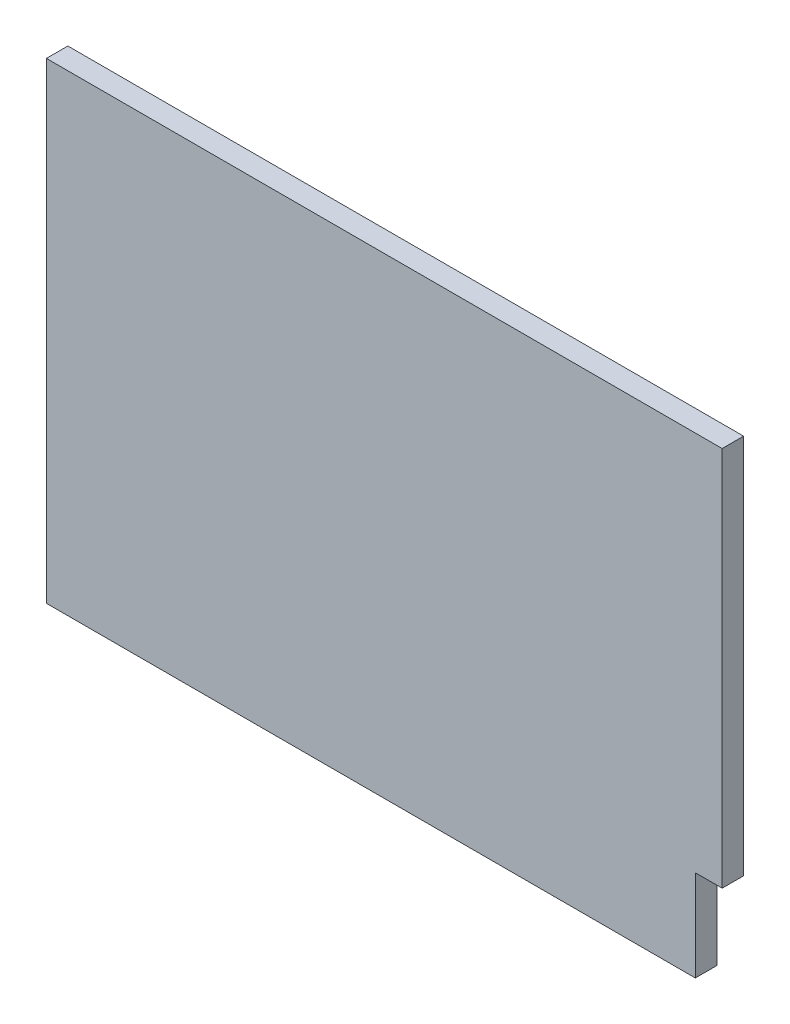
ISO-10303-21;
HEADER;
FILE_DESCRIPTION(('STEP AP214'),'2;1');
FILE_NAME('part.step','',(''),(''),'','','');
FILE_SCHEMA(('AUTOMOTIVE_DESIGN { 1 0 10303 214 1 1 1 1 }'));
ENDSEC;
DATA;
#1=APPLICATION_CONTEXT('core data for automotive mechanical design processes');
#2=APPLICATION_PROTOCOL_DEFINITION('international standard','automotive_design',2000,#1);
#3=PRODUCT_CONTEXT('',#1,'mechanical');
#4=PRODUCT('Part','Part','',(#3));
#5=PRODUCT_RELATED_PRODUCT_CATEGORY('part','',(#4));
#6=PRODUCT_DEFINITION_FORMATION('','',#4);
#7=PRODUCT_DEFINITION_CONTEXT('part definition',#1,'design');
#8=PRODUCT_DEFINITION('design','',#6,#7);
#9=PRODUCT_DEFINITION_SHAPE('','',#8);
#10=(LENGTH_UNIT() NAMED_UNIT(*) SI_UNIT(.MILLI.,.METRE.));
#11=(NAMED_UNIT(*) PLANE_ANGLE_UNIT() SI_UNIT($,.RADIAN.));
#12=(NAMED_UNIT(*) SI_UNIT($,.STERADIAN.) SOLID_ANGLE_UNIT());
#13=UNCERTAINTY_MEASURE_WITH_UNIT(LENGTH_MEASURE(1.E-05),#10,'distance_accuracy_value','');
#14=(GEOMETRIC_REPRESENTATION_CONTEXT(3) GLOBAL_UNCERTAINTY_ASSIGNED_CONTEXT((#13)) GLOBAL_UNIT_ASSIGNED_CONTEXT((#10,
#11,#12)) REPRESENTATION_CONTEXT('',''));
#15=CARTESIAN_POINT('',(0.,0.,0.));
#16=DIRECTION('',(0.,0.,1.));
#17=DIRECTION('',(1.,0.,0.));
#18=AXIS2_PLACEMENT_3D('',#15,#16,#17);
#19=CARTESIAN_POINT('',(-315.,220.,20.));
#20=DIRECTION('',(1.,0.,0.));
#21=DIRECTION('',(0.,0.,-1.));
#22=AXIS2_PLACEMENT_3D('',#19,#20,#21);
#23=PLANE('',#22);
#24=DIRECTION('',(0.,-1.,0.));
#25=VECTOR('',#24,1.);
#26=CARTESIAN_POINT('',(-315.,220.,0.));
#27=LINE('',#26,#25);
#28=CARTESIAN_POINT('',(-315.,220.,0.));
#29=VERTEX_POINT('',#28);
#30=CARTESIAN_POINT('',(-315.,-220.,0.));
#31=VERTEX_POINT('',#30);
#32=EDGE_CURVE('E119',#29,#31,#27,.T.);
#33=ORIENTED_EDGE('',*,*,#32,.T.);
#34=DIRECTION('',(0.,0.,-1.));
#35=VECTOR('',#34,1.);
#36=CARTESIAN_POINT('',(-315.,-220.,20.));
#37=LINE('',#36,#35);
#38=CARTESIAN_POINT('',(-315.,-220.,20.));
#39=VERTEX_POINT('',#38);
#40=EDGE_CURVE('E11',#39,#31,#37,.T.);
#41=ORIENTED_EDGE('',*,*,#40,.F.);
#42=DIRECTION('',(0.,-1.,0.));
#43=VECTOR('',#42,1.);
#44=CARTESIAN_POINT('',(-315.,220.,20.));
#45=LINE('',#44,#43);
#46=CARTESIAN_POINT('',(-315.,220.,20.));
#47=VERTEX_POINT('',#46);
#48=EDGE_CURVE('E129',#47,#39,#45,.T.);
#49=ORIENTED_EDGE('',*,*,#48,.F.);
#50=DIRECTION('',(0.,0.,-1.));
#51=VECTOR('',#50,1.);
#52=CARTESIAN_POINT('',(-315.,220.,20.));
#53=LINE('',#52,#51);
#54=EDGE_CURVE('E115',#47,#29,#53,.T.);
#55=ORIENTED_EDGE('',*,*,#54,.T.);
#56=EDGE_LOOP('',(#33,#41,#49,#55));
#57=FACE_BOUND('',#56,.T.);
#58=ADVANCED_FACE('F35',(#57),#23,.F.);
#59=CARTESIAN_POINT('',(-315.,-220.,20.));
#60=DIRECTION('',(0.,1.,0.));
#61=DIRECTION('',(0.,0.,1.));
#62=AXIS2_PLACEMENT_3D('',#59,#60,#61);
#63=PLANE('',#62);
#64=DIRECTION('',(1.,0.,0.));
#65=VECTOR('',#64,1.);
#66=CARTESIAN_POINT('',(-315.,-220.,0.));
#67=LINE('',#66,#65);
#68=CARTESIAN_POINT('',(290.,-220.,0.));
#69=VERTEX_POINT('',#68);
#70=EDGE_CURVE('E122',#31,#69,#67,.T.);
#71=ORIENTED_EDGE('',*,*,#70,.T.);
#72=DIRECTION('',(0.,0.,-1.));
#73=VECTOR('',#72,1.);
#74=CARTESIAN_POINT('',(290.,-220.,20.));
#75=LINE('',#74,#73);
#76=CARTESIAN_POINT('',(290.,-220.,20.));
#77=VERTEX_POINT('',#76);
#78=EDGE_CURVE('E43',#77,#69,#75,.T.);
#79=ORIENTED_EDGE('',*,*,#78,.F.);
#80=DIRECTION('',(1.,0.,0.));
#81=VECTOR('',#80,1.);
#82=CARTESIAN_POINT('',(-315.,-220.,20.));
#83=LINE('',#82,#81);
#84=EDGE_CURVE('E88',#39,#77,#83,.T.);
#85=ORIENTED_EDGE('',*,*,#84,.F.);
#86=ORIENTED_EDGE('',*,*,#40,.T.);
#87=EDGE_LOOP('',(#71,#79,#85,#86));
#88=FACE_BOUND('',#87,.T.);
#89=ADVANCED_FACE('F153',(#88),#63,.F.);
#90=CARTESIAN_POINT('',(290.,-135.,20.));
#91=DIRECTION('',(-1.,0.,0.));
#92=DIRECTION('',(0.,-1.,0.));
#93=AXIS2_PLACEMENT_3D('',#90,#91,#92);
#94=PLANE('',#93);
#95=DIRECTION('',(0.,1.,0.));
#96=VECTOR('',#95,1.);
#97=CARTESIAN_POINT('',(290.,-135.,0.));
#98=LINE('',#97,#96);
#99=CARTESIAN_POINT('',(290.,-135.,0.));
#100=VERTEX_POINT('',#99);
#101=EDGE_CURVE('E124',#69,#100,#98,.T.);
#102=ORIENTED_EDGE('',*,*,#101,.T.);
#103=DIRECTION('',(0.,0.,-1.));
#104=VECTOR('',#103,1.);
#105=CARTESIAN_POINT('',(290.,-135.,20.));
#106=LINE('',#105,#104);
#107=CARTESIAN_POINT('',(290.,-135.,20.));
#108=VERTEX_POINT('',#107);
#109=EDGE_CURVE('E110',#108,#100,#106,.T.);
#110=ORIENTED_EDGE('',*,*,#109,.F.);
#111=DIRECTION('',(0.,1.,0.));
#112=VECTOR('',#111,1.);
#113=CARTESIAN_POINT('',(290.,-135.,20.));
#114=LINE('',#113,#112);
#115=EDGE_CURVE('E101',#77,#108,#114,.T.);
#116=ORIENTED_EDGE('',*,*,#115,.F.);
#117=ORIENTED_EDGE('',*,*,#78,.T.);
#118=EDGE_LOOP('',(#102,#110,#116,#117));
#119=FACE_BOUND('',#118,.T.);
#120=ADVANCED_FACE('F135',(#119),#94,.F.);
#121=CARTESIAN_POINT('',(315.,-135.,20.));
#122=DIRECTION('',(0.,1.,0.));
#123=DIRECTION('',(-1.,0.,0.));
#124=AXIS2_PLACEMENT_3D('',#121,#122,#123);
#125=PLANE('',#124);
#126=DIRECTION('',(1.,0.,0.));
#127=VECTOR('',#126,1.);
#128=CARTESIAN_POINT('',(315.,-135.,0.));
#129=LINE('',#128,#127);
#130=CARTESIAN_POINT('',(315.,-135.,0.));
#131=VERTEX_POINT('',#130);
#132=EDGE_CURVE('E109',#100,#131,#129,.T.);
#133=ORIENTED_EDGE('',*,*,#132,.T.);
#134=DIRECTION('',(0.,0.,-1.));
#135=VECTOR('',#134,1.);
#136=CARTESIAN_POINT('',(315.,-135.,20.));
#137=LINE('',#136,#135);
#138=CARTESIAN_POINT('',(315.,-135.,20.));
#139=VERTEX_POINT('',#138);
#140=EDGE_CURVE('E106',#139,#131,#137,.T.);
#141=ORIENTED_EDGE('',*,*,#140,.F.);
#142=DIRECTION('',(1.,0.,0.));
#143=VECTOR('',#142,1.);
#144=CARTESIAN_POINT('',(315.,-135.,20.));
#145=LINE('',#144,#143);
#146=EDGE_CURVE('E95',#108,#139,#145,.T.);
#147=ORIENTED_EDGE('',*,*,#146,.F.);
#148=ORIENTED_EDGE('',*,*,#109,.T.);
#149=EDGE_LOOP('',(#133,#141,#147,#148));
#150=FACE_BOUND('',#149,.T.);
#151=ADVANCED_FACE('F107',(#150),#125,.F.);
#152=CARTESIAN_POINT('',(315.,220.,20.));
#153=DIRECTION('',(-1.,0.,0.));
#154=DIRECTION('',(0.,-1.,0.));
#155=AXIS2_PLACEMENT_3D('',#152,#153,#154);
#156=PLANE('',#155);
#157=DIRECTION('',(0.,1.,0.));
#158=VECTOR('',#157,1.);
#159=CARTESIAN_POINT('',(315.,220.,0.));
#160=LINE('',#159,#158);
#161=CARTESIAN_POINT('',(315.,220.,0.));
#162=VERTEX_POINT('',#161);
#163=EDGE_CURVE('E74',#131,#162,#160,.T.);
#164=ORIENTED_EDGE('',*,*,#163,.T.);
#165=DIRECTION('',(0.,0.,-1.));
#166=VECTOR('',#165,1.);
#167=CARTESIAN_POINT('',(315.,220.,20.));
#168=LINE('',#167,#166);
#169=CARTESIAN_POINT('',(315.,220.,20.));
#170=VERTEX_POINT('',#169);
#171=EDGE_CURVE('E111',#170,#162,#168,.T.);
#172=ORIENTED_EDGE('',*,*,#171,.F.);
#173=DIRECTION('',(0.,1.,0.));
#174=VECTOR('',#173,1.);
#175=CARTESIAN_POINT('',(315.,220.,20.));
#176=LINE('',#175,#174);
#177=EDGE_CURVE('E99',#139,#170,#176,.T.);
#178=ORIENTED_EDGE('',*,*,#177,.F.);
#179=ORIENTED_EDGE('',*,*,#140,.T.);
#180=EDGE_LOOP('',(#164,#172,#178,#179));
#181=FACE_BOUND('',#180,.T.);
#182=ADVANCED_FACE('F113',(#181),#156,.F.);
#183=CARTESIAN_POINT('',(-315.,220.,20.));
#184=DIRECTION('',(0.,-1.,0.));
#185=DIRECTION('',(0.,0.,-1.));
#186=AXIS2_PLACEMENT_3D('',#183,#184,#185);
#187=PLANE('',#186);
#188=DIRECTION('',(-1.,0.,0.));
#189=VECTOR('',#188,1.);
#190=CARTESIAN_POINT('',(-315.,220.,0.));
#191=LINE('',#190,#189);
#192=EDGE_CURVE('E80',#162,#29,#191,.T.);
#193=ORIENTED_EDGE('',*,*,#192,.T.);
#194=ORIENTED_EDGE('',*,*,#54,.F.);
#195=DIRECTION('',(-1.,0.,0.));
#196=VECTOR('',#195,1.);
#197=CARTESIAN_POINT('',(-315.,220.,20.));
#198=LINE('',#197,#196);
#199=EDGE_CURVE('E51',#170,#47,#198,.T.);
#200=ORIENTED_EDGE('',*,*,#199,.F.);
#201=ORIENTED_EDGE('',*,*,#171,.T.);
#202=EDGE_LOOP('',(#193,#194,#200,#201));
#203=FACE_BOUND('',#202,.T.);
#204=ADVANCED_FACE('F142',(#203),#187,.F.);
#205=CARTESIAN_POINT('',(0.,0.,20.));
#206=DIRECTION('',(0.,0.,1.));
#207=DIRECTION('',(1.,0.,0.));
#208=AXIS2_PLACEMENT_3D('',#205,#206,#207);
#209=PLANE('',#208);
#210=ORIENTED_EDGE('',*,*,#48,.T.);
#211=ORIENTED_EDGE('',*,*,#84,.T.);
#212=ORIENTED_EDGE('',*,*,#115,.T.);
#213=ORIENTED_EDGE('',*,*,#146,.T.);
#214=ORIENTED_EDGE('',*,*,#177,.T.);
#215=ORIENTED_EDGE('',*,*,#199,.T.);
#216=EDGE_LOOP('',(#210,#211,#212,#213,#214,#215));
#217=FACE_BOUND('',#216,.T.);
#218=ADVANCED_FACE('F97',(#217),#209,.T.);
#219=CARTESIAN_POINT('',(0.,0.,0.));
#220=DIRECTION('',(0.,0.,1.));
#221=DIRECTION('',(1.,0.,0.));
#222=AXIS2_PLACEMENT_3D('',#219,#220,#221);
#223=PLANE('',#222);
#224=ORIENTED_EDGE('',*,*,#32,.F.);
#225=ORIENTED_EDGE('',*,*,#192,.F.);
#226=ORIENTED_EDGE('',*,*,#163,.F.);
#227=ORIENTED_EDGE('',*,*,#132,.F.);
#228=ORIENTED_EDGE('',*,*,#101,.F.);
#229=ORIENTED_EDGE('',*,*,#70,.F.);
#230=EDGE_LOOP('',(#224,#225,#226,#227,#228,#229));
#231=FACE_BOUND('',#230,.T.);
#232=ADVANCED_FACE('F138',(#231),#223,.F.);
#233=CLOSED_SHELL('',(#58,#89,#120,#151,#182,#204,#218,#232));
#234=MANIFOLD_SOLID_BREP('B2',#233);
#235=ADVANCED_BREP_SHAPE_REPRESENTATION('',(#18,#234),#14);
#236=SHAPE_DEFINITION_REPRESENTATION(#9,#235);
ENDSEC;
END-ISO-10303-21;
